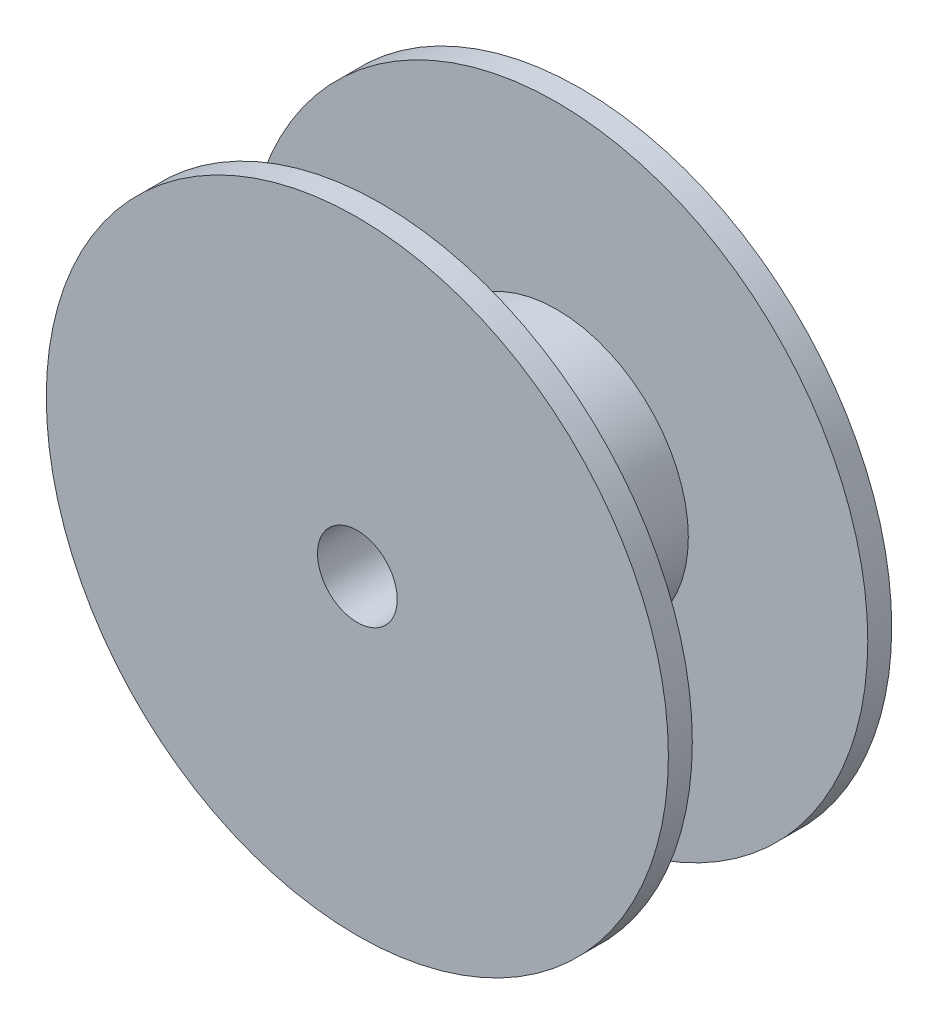
ISO-10303-21;
HEADER;
FILE_DESCRIPTION(('STEP AP214'),'2;1');
FILE_NAME('part.step','',(''),(''),'','','');
FILE_SCHEMA(('AUTOMOTIVE_DESIGN { 1 0 10303 214 1 1 1 1 }'));
ENDSEC;
DATA;
#1=APPLICATION_CONTEXT('core data for automotive mechanical design processes');
#2=APPLICATION_PROTOCOL_DEFINITION('international standard','automotive_design',2000,#1);
#3=PRODUCT_CONTEXT('',#1,'mechanical');
#4=PRODUCT('Part','Part','',(#3));
#5=PRODUCT_RELATED_PRODUCT_CATEGORY('part','',(#4));
#6=PRODUCT_DEFINITION_FORMATION('','',#4);
#7=PRODUCT_DEFINITION_CONTEXT('part definition',#1,'design');
#8=PRODUCT_DEFINITION('design','',#6,#7);
#9=PRODUCT_DEFINITION_SHAPE('','',#8);
#10=(LENGTH_UNIT() NAMED_UNIT(*) SI_UNIT(.MILLI.,.METRE.));
#11=(NAMED_UNIT(*) PLANE_ANGLE_UNIT() SI_UNIT($,.RADIAN.));
#12=(NAMED_UNIT(*) SI_UNIT($,.STERADIAN.) SOLID_ANGLE_UNIT());
#13=UNCERTAINTY_MEASURE_WITH_UNIT(LENGTH_MEASURE(1.E-05),#10,'distance_accuracy_value','');
#14=(GEOMETRIC_REPRESENTATION_CONTEXT(3) GLOBAL_UNCERTAINTY_ASSIGNED_CONTEXT((#13)) GLOBAL_UNIT_ASSIGNED_CONTEXT((#10,
#11,#12)) REPRESENTATION_CONTEXT('',''));
#15=CARTESIAN_POINT('',(0.,0.,0.));
#16=DIRECTION('',(0.,0.,1.));
#17=DIRECTION('',(1.,0.,0.));
#18=AXIS2_PLACEMENT_3D('',#15,#16,#17);
#19=CARTESIAN_POINT('',(0.,0.,-35.56));
#20=DIRECTION('',(0.,0.,1.));
#21=DIRECTION('',(1.,0.,0.));
#22=AXIS2_PLACEMENT_3D('',#19,#20,#21);
#23=CYLINDRICAL_SURFACE('',#22,99.06);
#24=CARTESIAN_POINT('',(0.,0.,27.94));
#25=DIRECTION('',(0.,0.,1.));
#26=DIRECTION('',(1.,0.,0.));
#27=AXIS2_PLACEMENT_3D('',#24,#25,#26);
#28=CIRCLE('',#27,99.06);
#29=CARTESIAN_POINT('',(99.06,0.,27.94));
#30=VERTEX_POINT('',#29);
#31=EDGE_CURVE('E35',#30,#30,#28,.F.);
#32=ORIENTED_EDGE('',*,*,#31,.F.);
#33=EDGE_LOOP('',(#32));
#34=FACE_BOUND('',#33,.T.);
#35=CARTESIAN_POINT('',(0.,0.,35.56));
#36=DIRECTION('',(0.,0.,1.));
#37=DIRECTION('',(1.,0.,0.));
#38=AXIS2_PLACEMENT_3D('',#35,#36,#37);
#39=CIRCLE('',#38,99.06);
#40=CARTESIAN_POINT('',(99.06,0.,35.56));
#41=VERTEX_POINT('',#40);
#42=EDGE_CURVE('E39',#41,#41,#39,.T.);
#43=ORIENTED_EDGE('',*,*,#42,.F.);
#44=EDGE_LOOP('',(#43));
#45=FACE_BOUND('',#44,.T.);
#46=ADVANCED_FACE('F32',(#34,#45),#23,.T.);
#47=CARTESIAN_POINT('',(0.,0.,35.56));
#48=DIRECTION('',(0.,0.,1.));
#49=DIRECTION('',(1.,0.,0.));
#50=AXIS2_PLACEMENT_3D('',#47,#48,#49);
#51=PLANE('',#50);
#52=CARTESIAN_POINT('',(0.,0.,35.56));
#53=DIRECTION('',(0.,0.,1.));
#54=DIRECTION('',(1.,0.,0.));
#55=AXIS2_PLACEMENT_3D('',#52,#53,#54);
#56=CIRCLE('',#55,12.7);
#57=CARTESIAN_POINT('',(12.7,0.,35.56));
#58=VERTEX_POINT('',#57);
#59=EDGE_CURVE('E62',#58,#58,#56,.T.);
#60=ORIENTED_EDGE('',*,*,#59,.F.);
#61=EDGE_LOOP('',(#60));
#62=FACE_BOUND('',#61,.T.);
#63=ORIENTED_EDGE('',*,*,#42,.T.);
#64=EDGE_LOOP('',(#63));
#65=FACE_BOUND('',#64,.T.);
#66=ADVANCED_FACE('F68',(#62,#65),#51,.T.);
#67=CARTESIAN_POINT('',(0.,0.,27.94));
#68=DIRECTION('',(0.,0.,1.));
#69=DIRECTION('',(1.,0.,0.));
#70=AXIS2_PLACEMENT_3D('',#67,#68,#69);
#71=PLANE('',#70);
#72=ORIENTED_EDGE('',*,*,#31,.T.);
#73=EDGE_LOOP('',(#72));
#74=FACE_BOUND('',#73,.T.);
#75=CARTESIAN_POINT('',(0.,0.,27.94));
#76=DIRECTION('',(0.,0.,1.));
#77=DIRECTION('',(1.,0.,0.));
#78=AXIS2_PLACEMENT_3D('',#75,#76,#77);
#79=CIRCLE('',#78,41.91);
#80=CARTESIAN_POINT('',(41.91,0.,27.94));
#81=VERTEX_POINT('',#80);
#82=EDGE_CURVE('E48',#81,#81,#79,.T.);
#83=ORIENTED_EDGE('',*,*,#82,.T.);
#84=EDGE_LOOP('',(#83));
#85=FACE_BOUND('',#84,.T.);
#86=ADVANCED_FACE('F71',(#74,#85),#71,.F.);
#87=CARTESIAN_POINT('',(0.,0.,27.94));
#88=DIRECTION('',(0.,0.,-1.));
#89=DIRECTION('',(-1.,0.,0.));
#90=AXIS2_PLACEMENT_3D('',#87,#88,#89);
#91=CYLINDRICAL_SURFACE('',#90,41.91);
#92=ORIENTED_EDGE('',*,*,#82,.F.);
#93=EDGE_LOOP('',(#92));
#94=FACE_BOUND('',#93,.T.);
#95=CARTESIAN_POINT('',(0.,0.,-27.94));
#96=DIRECTION('',(0.,0.,1.));
#97=DIRECTION('',(1.,0.,0.));
#98=AXIS2_PLACEMENT_3D('',#95,#96,#97);
#99=CIRCLE('',#98,41.91);
#100=CARTESIAN_POINT('',(41.91,0.,-27.94));
#101=VERTEX_POINT('',#100);
#102=EDGE_CURVE('E53',#101,#101,#99,.T.);
#103=ORIENTED_EDGE('',*,*,#102,.T.);
#104=EDGE_LOOP('',(#103));
#105=FACE_BOUND('',#104,.T.);
#106=ADVANCED_FACE('F94',(#94,#105),#91,.T.);
#107=CARTESIAN_POINT('',(0.,0.,-27.94));
#108=DIRECTION('',(0.,0.,1.));
#109=DIRECTION('',(1.,0.,0.));
#110=AXIS2_PLACEMENT_3D('',#107,#108,#109);
#111=PLANE('',#110);
#112=CARTESIAN_POINT('',(0.,0.,-27.94));
#113=DIRECTION('',(0.,0.,1.));
#114=DIRECTION('',(1.,0.,0.));
#115=AXIS2_PLACEMENT_3D('',#112,#113,#114);
#116=CIRCLE('',#115,99.06);
#117=CARTESIAN_POINT('',(99.06,0.,-27.94));
#118=VERTEX_POINT('',#117);
#119=EDGE_CURVE('E46',#118,#118,#116,.F.);
#120=ORIENTED_EDGE('',*,*,#119,.F.);
#121=EDGE_LOOP('',(#120));
#122=FACE_BOUND('',#121,.T.);
#123=ORIENTED_EDGE('',*,*,#102,.F.);
#124=EDGE_LOOP('',(#123));
#125=FACE_BOUND('',#124,.T.);
#126=ADVANCED_FACE('F89',(#122,#125),#111,.T.);
#127=CARTESIAN_POINT('',(0.,0.,-35.56));
#128=DIRECTION('',(0.,0.,1.));
#129=DIRECTION('',(1.,0.,0.));
#130=AXIS2_PLACEMENT_3D('',#127,#128,#129);
#131=PLANE('',#130);
#132=CARTESIAN_POINT('',(0.,0.,-35.56));
#133=DIRECTION('',(0.,0.,1.));
#134=DIRECTION('',(1.,0.,0.));
#135=AXIS2_PLACEMENT_3D('',#132,#133,#134);
#136=CIRCLE('',#135,12.7);
#137=CARTESIAN_POINT('',(12.7,0.,-35.56));
#138=VERTEX_POINT('',#137);
#139=EDGE_CURVE('E57',#138,#138,#136,.T.);
#140=ORIENTED_EDGE('',*,*,#139,.T.);
#141=EDGE_LOOP('',(#140));
#142=FACE_BOUND('',#141,.T.);
#143=CARTESIAN_POINT('',(0.,0.,-35.56));
#144=DIRECTION('',(0.,0.,1.));
#145=DIRECTION('',(1.,0.,0.));
#146=AXIS2_PLACEMENT_3D('',#143,#144,#145);
#147=CIRCLE('',#146,99.06);
#148=CARTESIAN_POINT('',(99.06,0.,-35.56));
#149=VERTEX_POINT('',#148);
#150=EDGE_CURVE('E11',#149,#149,#147,.T.);
#151=ORIENTED_EDGE('',*,*,#150,.F.);
#152=EDGE_LOOP('',(#151));
#153=FACE_BOUND('',#152,.T.);
#154=ADVANCED_FACE('F82',(#142,#153),#131,.F.);
#155=ORIENTED_EDGE('',*,*,#150,.T.);
#156=EDGE_LOOP('',(#155));
#157=FACE_BOUND('',#156,.T.);
#158=ORIENTED_EDGE('',*,*,#119,.T.);
#159=EDGE_LOOP('',(#158));
#160=FACE_BOUND('',#159,.T.);
#161=ADVANCED_FACE('F77',(#157,#160),#23,.T.);
#162=CARTESIAN_POINT('',(0.,0.,-35.56));
#163=DIRECTION('',(0.,0.,1.));
#164=DIRECTION('',(1.,0.,0.));
#165=AXIS2_PLACEMENT_3D('',#162,#163,#164);
#166=CYLINDRICAL_SURFACE('',#165,12.7);
#167=ORIENTED_EDGE('',*,*,#139,.F.);
#168=EDGE_LOOP('',(#167));
#169=FACE_BOUND('',#168,.T.);
#170=ORIENTED_EDGE('',*,*,#59,.T.);
#171=EDGE_LOOP('',(#170));
#172=FACE_BOUND('',#171,.T.);
#173=ADVANCED_FACE('F66',(#169,#172),#166,.F.);
#174=CLOSED_SHELL('',(#46,#66,#86,#106,#126,#154,#161,#173));
#175=MANIFOLD_SOLID_BREP('B2',#174);
#176=ADVANCED_BREP_SHAPE_REPRESENTATION('',(#18,#175),#14);
#177=SHAPE_DEFINITION_REPRESENTATION(#9,#176);
ENDSEC;
END-ISO-10303-21;
